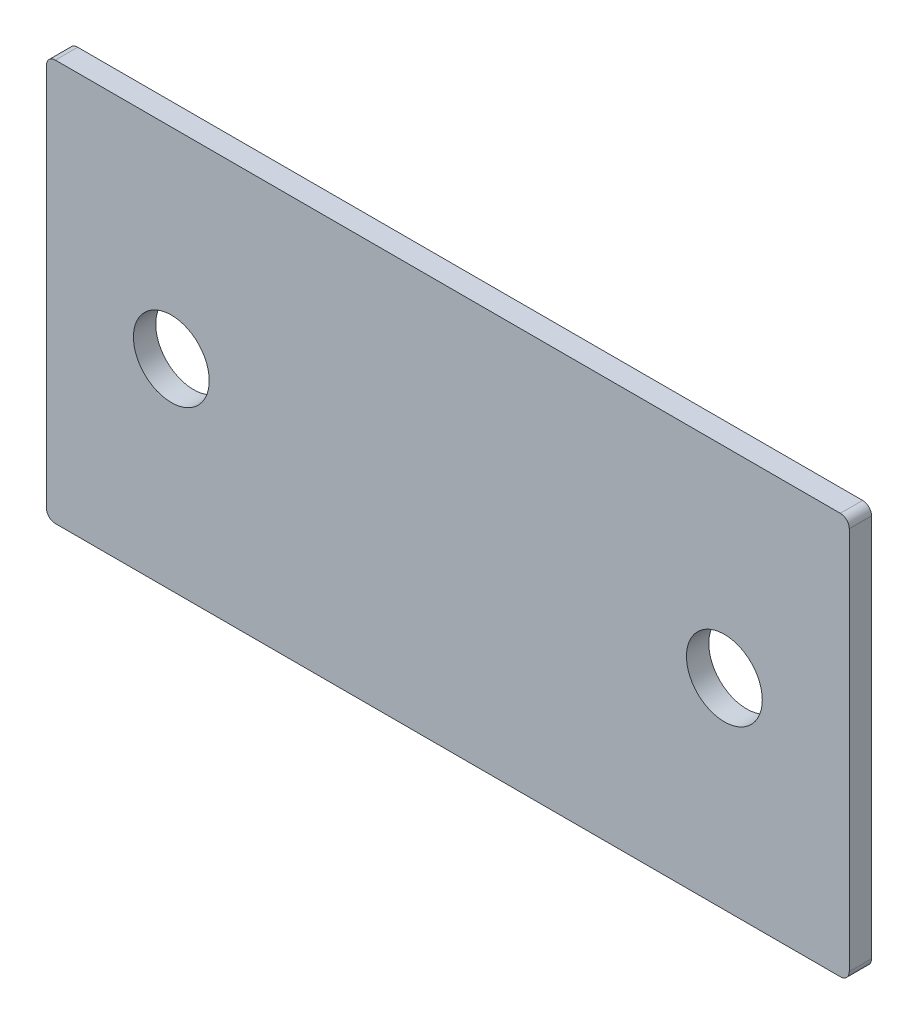
ISO-10303-21;
HEADER;
FILE_DESCRIPTION(('STEP AP214'),'2;1');
FILE_NAME('part.step','',(''),(''),'','','');
FILE_SCHEMA(('AUTOMOTIVE_DESIGN { 1 0 10303 214 1 1 1 1 }'));
ENDSEC;
DATA;
#1=APPLICATION_CONTEXT('core data for automotive mechanical design processes');
#2=APPLICATION_PROTOCOL_DEFINITION('international standard','automotive_design',2000,#1);
#3=PRODUCT_CONTEXT('',#1,'mechanical');
#4=PRODUCT('Part','Part','',(#3));
#5=PRODUCT_RELATED_PRODUCT_CATEGORY('part','',(#4));
#6=PRODUCT_DEFINITION_FORMATION('','',#4);
#7=PRODUCT_DEFINITION_CONTEXT('part definition',#1,'design');
#8=PRODUCT_DEFINITION('design','',#6,#7);
#9=PRODUCT_DEFINITION_SHAPE('','',#8);
#10=(LENGTH_UNIT() NAMED_UNIT(*) SI_UNIT(.MILLI.,.METRE.));
#11=(NAMED_UNIT(*) PLANE_ANGLE_UNIT() SI_UNIT($,.RADIAN.));
#12=(NAMED_UNIT(*) SI_UNIT($,.STERADIAN.) SOLID_ANGLE_UNIT());
#13=UNCERTAINTY_MEASURE_WITH_UNIT(LENGTH_MEASURE(1.E-05),#10,'distance_accuracy_value','');
#14=(GEOMETRIC_REPRESENTATION_CONTEXT(3) GLOBAL_UNCERTAINTY_ASSIGNED_CONTEXT((#13)) GLOBAL_UNIT_ASSIGNED_CONTEXT((#10,
#11,#12)) REPRESENTATION_CONTEXT('',''));
#15=CARTESIAN_POINT('',(0.,0.,0.));
#16=DIRECTION('',(0.,0.,1.));
#17=DIRECTION('',(1.,0.,0.));
#18=AXIS2_PLACEMENT_3D('',#15,#16,#17);
#19=CARTESIAN_POINT('',(0.,0.,2.5));
#20=DIRECTION('',(0.,0.,-1.));
#21=DIRECTION('',(-1.,0.,0.));
#22=AXIS2_PLACEMENT_3D('',#19,#20,#21);
#23=PLANE('',#22);
#24=DIRECTION('',(0.,-1.,0.));
#25=VECTOR('',#24,1.);
#26=CARTESIAN_POINT('',(-45.,-22.5,2.5));
#27=LINE('',#26,#25);
#28=CARTESIAN_POINT('',(-45.,21.5,2.5));
#29=VERTEX_POINT('',#28);
#30=CARTESIAN_POINT('',(-45.,-21.5,2.5));
#31=VERTEX_POINT('',#30);
#32=EDGE_CURVE('E173',#29,#31,#27,.T.);
#33=ORIENTED_EDGE('',*,*,#32,.T.);
#34=CARTESIAN_POINT('',(-44.,-21.5,2.5));
#35=DIRECTION('',(0.,0.,-1.));
#36=DIRECTION('',(-1.,0.,0.));
#37=AXIS2_PLACEMENT_3D('',#34,#35,#36);
#38=CIRCLE('',#37,1.);
#39=CARTESIAN_POINT('',(-44.,-22.5,2.5));
#40=VERTEX_POINT('',#39);
#41=EDGE_CURVE('E150',#31,#40,#38,.F.);
#42=ORIENTED_EDGE('',*,*,#41,.T.);
#43=DIRECTION('',(1.,0.,0.));
#44=VECTOR('',#43,1.);
#45=CARTESIAN_POINT('',(-45.,-22.5,2.5));
#46=LINE('',#45,#44);
#47=CARTESIAN_POINT('',(44.,-22.5,2.5));
#48=VERTEX_POINT('',#47);
#49=EDGE_CURVE('E121',#40,#48,#46,.T.);
#50=ORIENTED_EDGE('',*,*,#49,.T.);
#51=CARTESIAN_POINT('',(44.,-21.5,2.5));
#52=DIRECTION('',(0.,0.,-1.));
#53=DIRECTION('',(-1.,0.,0.));
#54=AXIS2_PLACEMENT_3D('',#51,#52,#53);
#55=CIRCLE('',#54,1.);
#56=CARTESIAN_POINT('',(45.,-21.5,2.5));
#57=VERTEX_POINT('',#56);
#58=EDGE_CURVE('E146',#48,#57,#55,.F.);
#59=ORIENTED_EDGE('',*,*,#58,.T.);
#60=DIRECTION('',(0.,1.,0.));
#61=VECTOR('',#60,1.);
#62=CARTESIAN_POINT('',(45.,-22.5,2.5));
#63=LINE('',#62,#61);
#64=CARTESIAN_POINT('',(45.,21.5,2.5));
#65=VERTEX_POINT('',#64);
#66=EDGE_CURVE('E129',#57,#65,#63,.T.);
#67=ORIENTED_EDGE('',*,*,#66,.T.);
#68=CARTESIAN_POINT('',(44.,21.5,2.5));
#69=DIRECTION('',(0.,0.,-1.));
#70=DIRECTION('',(-1.,0.,0.));
#71=AXIS2_PLACEMENT_3D('',#68,#69,#70);
#72=CIRCLE('',#71,1.);
#73=CARTESIAN_POINT('',(44.,22.5,2.5));
#74=VERTEX_POINT('',#73);
#75=EDGE_CURVE('E56',#65,#74,#72,.F.);
#76=ORIENTED_EDGE('',*,*,#75,.T.);
#77=DIRECTION('',(-1.,0.,0.));
#78=VECTOR('',#77,1.);
#79=CARTESIAN_POINT('',(-45.,22.5,2.5));
#80=LINE('',#79,#78);
#81=CARTESIAN_POINT('',(-44.,22.5,2.5));
#82=VERTEX_POINT('',#81);
#83=EDGE_CURVE('E132',#74,#82,#80,.T.);
#84=ORIENTED_EDGE('',*,*,#83,.T.);
#85=CARTESIAN_POINT('',(-44.,21.5,2.5));
#86=DIRECTION('',(0.,0.,-1.));
#87=DIRECTION('',(-1.,0.,0.));
#88=AXIS2_PLACEMENT_3D('',#85,#86,#87);
#89=CIRCLE('',#88,1.);
#90=EDGE_CURVE('E148',#82,#29,#89,.F.);
#91=ORIENTED_EDGE('',*,*,#90,.T.);
#92=EDGE_LOOP('',(#33,#42,#50,#59,#67,#76,#84,#91));
#93=FACE_BOUND('',#92,.T.);
#94=CARTESIAN_POINT('',(-31.,0.,2.5));
#95=DIRECTION('',(0.,0.,1.));
#96=DIRECTION('',(1.,0.,0.));
#97=AXIS2_PLACEMENT_3D('',#94,#95,#96);
#98=CIRCLE('',#97,4.25);
#99=CARTESIAN_POINT('',(-26.75,0.,2.5));
#100=VERTEX_POINT('',#99);
#101=EDGE_CURVE('E169',#100,#100,#98,.T.);
#102=ORIENTED_EDGE('',*,*,#101,.F.);
#103=EDGE_LOOP('',(#102));
#104=FACE_BOUND('',#103,.T.);
#105=CARTESIAN_POINT('',(31.,0.,2.5));
#106=DIRECTION('',(0.,0.,1.));
#107=DIRECTION('',(1.,0.,0.));
#108=AXIS2_PLACEMENT_3D('',#105,#106,#107);
#109=CIRCLE('',#108,4.25);
#110=CARTESIAN_POINT('',(35.25,0.,2.5));
#111=VERTEX_POINT('',#110);
#112=EDGE_CURVE('E179',#111,#111,#109,.T.);
#113=ORIENTED_EDGE('',*,*,#112,.F.);
#114=EDGE_LOOP('',(#113));
#115=FACE_BOUND('',#114,.T.);
#116=ADVANCED_FACE('F34',(#93,#104,#115),#23,.F.);
#117=CARTESIAN_POINT('',(0.,0.,0.));
#118=DIRECTION('',(0.,0.,-1.));
#119=DIRECTION('',(-1.,0.,0.));
#120=AXIS2_PLACEMENT_3D('',#117,#118,#119);
#121=PLANE('',#120);
#122=CARTESIAN_POINT('',(-31.,0.,0.));
#123=DIRECTION('',(0.,0.,1.));
#124=DIRECTION('',(1.,0.,0.));
#125=AXIS2_PLACEMENT_3D('',#122,#123,#124);
#126=CIRCLE('',#125,4.25);
#127=CARTESIAN_POINT('',(-26.75,0.,0.));
#128=VERTEX_POINT('',#127);
#129=EDGE_CURVE('E176',#128,#128,#126,.T.);
#130=ORIENTED_EDGE('',*,*,#129,.T.);
#131=EDGE_LOOP('',(#130));
#132=FACE_BOUND('',#131,.T.);
#133=DIRECTION('',(1.,0.,0.));
#134=VECTOR('',#133,1.);
#135=CARTESIAN_POINT('',(-45.,-22.5,0.));
#136=LINE('',#135,#134);
#137=CARTESIAN_POINT('',(-44.,-22.5,0.));
#138=VERTEX_POINT('',#137);
#139=CARTESIAN_POINT('',(44.,-22.5,0.));
#140=VERTEX_POINT('',#139);
#141=EDGE_CURVE('E118',#138,#140,#136,.T.);
#142=ORIENTED_EDGE('',*,*,#141,.F.);
#143=CARTESIAN_POINT('',(-44.,-21.5,0.));
#144=DIRECTION('',(0.,0.,-1.));
#145=DIRECTION('',(-1.,0.,0.));
#146=AXIS2_PLACEMENT_3D('',#143,#144,#145);
#147=CIRCLE('',#146,1.);
#148=CARTESIAN_POINT('',(-45.,-21.5,0.));
#149=VERTEX_POINT('',#148);
#150=EDGE_CURVE('E101',#138,#149,#147,.T.);
#151=ORIENTED_EDGE('',*,*,#150,.T.);
#152=DIRECTION('',(0.,-1.,0.));
#153=VECTOR('',#152,1.);
#154=CARTESIAN_POINT('',(-45.,-22.5,0.));
#155=LINE('',#154,#153);
#156=CARTESIAN_POINT('',(-45.,21.5,0.));
#157=VERTEX_POINT('',#156);
#158=EDGE_CURVE('E130',#157,#149,#155,.T.);
#159=ORIENTED_EDGE('',*,*,#158,.F.);
#160=CARTESIAN_POINT('',(-44.,21.5,0.));
#161=DIRECTION('',(0.,0.,-1.));
#162=DIRECTION('',(-1.,0.,0.));
#163=AXIS2_PLACEMENT_3D('',#160,#161,#162);
#164=CIRCLE('',#163,1.);
#165=CARTESIAN_POINT('',(-44.,22.5,0.));
#166=VERTEX_POINT('',#165);
#167=EDGE_CURVE('E112',#157,#166,#164,.T.);
#168=ORIENTED_EDGE('',*,*,#167,.T.);
#169=DIRECTION('',(-1.,0.,0.));
#170=VECTOR('',#169,1.);
#171=CARTESIAN_POINT('',(-45.,22.5,0.));
#172=LINE('',#171,#170);
#173=CARTESIAN_POINT('',(44.,22.5,0.));
#174=VERTEX_POINT('',#173);
#175=EDGE_CURVE('E134',#174,#166,#172,.T.);
#176=ORIENTED_EDGE('',*,*,#175,.F.);
#177=CARTESIAN_POINT('',(44.,21.5,0.));
#178=DIRECTION('',(0.,0.,-1.));
#179=DIRECTION('',(-1.,0.,0.));
#180=AXIS2_PLACEMENT_3D('',#177,#178,#179);
#181=CIRCLE('',#180,1.);
#182=CARTESIAN_POINT('',(45.,21.5,0.));
#183=VERTEX_POINT('',#182);
#184=EDGE_CURVE('E122',#174,#183,#181,.T.);
#185=ORIENTED_EDGE('',*,*,#184,.T.);
#186=DIRECTION('',(0.,1.,0.));
#187=VECTOR('',#186,1.);
#188=CARTESIAN_POINT('',(45.,-22.5,0.));
#189=LINE('',#188,#187);
#190=CARTESIAN_POINT('',(45.,-21.5,0.));
#191=VERTEX_POINT('',#190);
#192=EDGE_CURVE('E161',#191,#183,#189,.T.);
#193=ORIENTED_EDGE('',*,*,#192,.F.);
#194=CARTESIAN_POINT('',(44.,-21.5,0.));
#195=DIRECTION('',(0.,0.,-1.));
#196=DIRECTION('',(-1.,0.,0.));
#197=AXIS2_PLACEMENT_3D('',#194,#195,#196);
#198=CIRCLE('',#197,1.);
#199=EDGE_CURVE('E128',#191,#140,#198,.T.);
#200=ORIENTED_EDGE('',*,*,#199,.T.);
#201=EDGE_LOOP('',(#142,#151,#159,#168,#176,#185,#193,#200));
#202=FACE_BOUND('',#201,.T.);
#203=CARTESIAN_POINT('',(31.,0.,0.));
#204=DIRECTION('',(0.,0.,1.));
#205=DIRECTION('',(1.,0.,0.));
#206=AXIS2_PLACEMENT_3D('',#203,#204,#205);
#207=CIRCLE('',#206,4.25);
#208=CARTESIAN_POINT('',(35.25,0.,0.));
#209=VERTEX_POINT('',#208);
#210=EDGE_CURVE('E182',#209,#209,#207,.T.);
#211=ORIENTED_EDGE('',*,*,#210,.T.);
#212=EDGE_LOOP('',(#211));
#213=FACE_BOUND('',#212,.T.);
#214=ADVANCED_FACE('F125',(#132,#202,#213),#121,.T.);
#215=CARTESIAN_POINT('',(45.,-22.5,2.5));
#216=DIRECTION('',(-1.,0.,0.));
#217=DIRECTION('',(0.,0.,1.));
#218=AXIS2_PLACEMENT_3D('',#215,#216,#217);
#219=PLANE('',#218);
#220=ORIENTED_EDGE('',*,*,#66,.F.);
#221=DIRECTION('',(0.,0.,-1.));
#222=VECTOR('',#221,1.);
#223=CARTESIAN_POINT('',(45.,-21.5,2.5));
#224=LINE('',#223,#222);
#225=EDGE_CURVE('E11',#57,#191,#224,.T.);
#226=ORIENTED_EDGE('',*,*,#225,.T.);
#227=ORIENTED_EDGE('',*,*,#192,.T.);
#228=DIRECTION('',(0.,0.,-1.));
#229=VECTOR('',#228,1.);
#230=CARTESIAN_POINT('',(45.,21.5,2.5));
#231=LINE('',#230,#229);
#232=EDGE_CURVE('E42',#183,#65,#231,.F.);
#233=ORIENTED_EDGE('',*,*,#232,.T.);
#234=EDGE_LOOP('',(#220,#226,#227,#233));
#235=FACE_BOUND('',#234,.T.);
#236=ADVANCED_FACE('F159',(#235),#219,.F.);
#237=CARTESIAN_POINT('',(-45.,22.5,2.5));
#238=DIRECTION('',(0.,-1.,0.));
#239=DIRECTION('',(0.,0.,-1.));
#240=AXIS2_PLACEMENT_3D('',#237,#238,#239);
#241=PLANE('',#240);
#242=ORIENTED_EDGE('',*,*,#175,.T.);
#243=DIRECTION('',(0.,0.,-1.));
#244=VECTOR('',#243,1.);
#245=CARTESIAN_POINT('',(-44.,22.5,2.5));
#246=LINE('',#245,#244);
#247=EDGE_CURVE('E49',#166,#82,#246,.F.);
#248=ORIENTED_EDGE('',*,*,#247,.T.);
#249=ORIENTED_EDGE('',*,*,#83,.F.);
#250=DIRECTION('',(0.,0.,-1.));
#251=VECTOR('',#250,1.);
#252=CARTESIAN_POINT('',(44.,22.5,2.5));
#253=LINE('',#252,#251);
#254=EDGE_CURVE('E152',#74,#174,#253,.T.);
#255=ORIENTED_EDGE('',*,*,#254,.T.);
#256=EDGE_LOOP('',(#242,#248,#249,#255));
#257=FACE_BOUND('',#256,.T.);
#258=ADVANCED_FACE('F168',(#257),#241,.F.);
#259=CARTESIAN_POINT('',(-45.,-22.5,2.5));
#260=DIRECTION('',(1.,0.,0.));
#261=DIRECTION('',(0.,0.,-1.));
#262=AXIS2_PLACEMENT_3D('',#259,#260,#261);
#263=PLANE('',#262);
#264=ORIENTED_EDGE('',*,*,#158,.T.);
#265=DIRECTION('',(0.,0.,-1.));
#266=VECTOR('',#265,1.);
#267=CARTESIAN_POINT('',(-45.,-21.5,2.5));
#268=LINE('',#267,#266);
#269=EDGE_CURVE('E106',#149,#31,#268,.F.);
#270=ORIENTED_EDGE('',*,*,#269,.T.);
#271=ORIENTED_EDGE('',*,*,#32,.F.);
#272=DIRECTION('',(0.,0.,-1.));
#273=VECTOR('',#272,1.);
#274=CARTESIAN_POINT('',(-45.,21.5,2.5));
#275=LINE('',#274,#273);
#276=EDGE_CURVE('E111',#29,#157,#275,.T.);
#277=ORIENTED_EDGE('',*,*,#276,.T.);
#278=EDGE_LOOP('',(#264,#270,#271,#277));
#279=FACE_BOUND('',#278,.T.);
#280=ADVANCED_FACE('F204',(#279),#263,.F.);
#281=CARTESIAN_POINT('',(-45.,-22.5,2.5));
#282=DIRECTION('',(0.,1.,0.));
#283=DIRECTION('',(0.,0.,1.));
#284=AXIS2_PLACEMENT_3D('',#281,#282,#283);
#285=PLANE('',#284);
#286=ORIENTED_EDGE('',*,*,#49,.F.);
#287=DIRECTION('',(0.,0.,-1.));
#288=VECTOR('',#287,1.);
#289=CARTESIAN_POINT('',(-44.,-22.5,2.5));
#290=LINE('',#289,#288);
#291=EDGE_CURVE('E105',#40,#138,#290,.T.);
#292=ORIENTED_EDGE('',*,*,#291,.T.);
#293=ORIENTED_EDGE('',*,*,#141,.T.);
#294=DIRECTION('',(0.,0.,-1.));
#295=VECTOR('',#294,1.);
#296=CARTESIAN_POINT('',(44.,-22.5,2.5));
#297=LINE('',#296,#295);
#298=EDGE_CURVE('E123',#140,#48,#297,.F.);
#299=ORIENTED_EDGE('',*,*,#298,.T.);
#300=EDGE_LOOP('',(#286,#292,#293,#299));
#301=FACE_BOUND('',#300,.T.);
#302=ADVANCED_FACE('F117',(#301),#285,.F.);
#303=CARTESIAN_POINT('',(-31.,0.,2.5));
#304=DIRECTION('',(0.,0.,-1.));
#305=DIRECTION('',(-1.,0.,0.));
#306=AXIS2_PLACEMENT_3D('',#303,#304,#305);
#307=CYLINDRICAL_SURFACE('',#306,4.25);
#308=ORIENTED_EDGE('',*,*,#101,.T.);
#309=EDGE_LOOP('',(#308));
#310=FACE_BOUND('',#309,.T.);
#311=ORIENTED_EDGE('',*,*,#129,.F.);
#312=EDGE_LOOP('',(#311));
#313=FACE_BOUND('',#312,.T.);
#314=ADVANCED_FACE('F199',(#310,#313),#307,.F.);
#315=CARTESIAN_POINT('',(31.,0.,2.5));
#316=DIRECTION('',(0.,0.,-1.));
#317=DIRECTION('',(-1.,0.,0.));
#318=AXIS2_PLACEMENT_3D('',#315,#316,#317);
#319=CYLINDRICAL_SURFACE('',#318,4.25);
#320=ORIENTED_EDGE('',*,*,#112,.T.);
#321=EDGE_LOOP('',(#320));
#322=FACE_BOUND('',#321,.T.);
#323=ORIENTED_EDGE('',*,*,#210,.F.);
#324=EDGE_LOOP('',(#323));
#325=FACE_BOUND('',#324,.T.);
#326=ADVANCED_FACE('F188',(#322,#325),#319,.F.);
#327=CARTESIAN_POINT('',(-44.,-21.5,2.5));
#328=DIRECTION('',(0.,0.,-1.));
#329=DIRECTION('',(-1.,0.,0.));
#330=AXIS2_PLACEMENT_3D('',#327,#328,#329);
#331=CYLINDRICAL_SURFACE('',#330,1.);
#332=ORIENTED_EDGE('',*,*,#41,.F.);
#333=ORIENTED_EDGE('',*,*,#269,.F.);
#334=ORIENTED_EDGE('',*,*,#150,.F.);
#335=ORIENTED_EDGE('',*,*,#291,.F.);
#336=EDGE_LOOP('',(#332,#333,#334,#335));
#337=FACE_BOUND('',#336,.T.);
#338=ADVANCED_FACE('F104',(#337),#331,.T.);
#339=CARTESIAN_POINT('',(-44.,21.5,2.5));
#340=DIRECTION('',(0.,0.,-1.));
#341=DIRECTION('',(-1.,0.,0.));
#342=AXIS2_PLACEMENT_3D('',#339,#340,#341);
#343=CYLINDRICAL_SURFACE('',#342,1.);
#344=ORIENTED_EDGE('',*,*,#90,.F.);
#345=ORIENTED_EDGE('',*,*,#247,.F.);
#346=ORIENTED_EDGE('',*,*,#167,.F.);
#347=ORIENTED_EDGE('',*,*,#276,.F.);
#348=EDGE_LOOP('',(#344,#345,#346,#347));
#349=FACE_BOUND('',#348,.T.);
#350=ADVANCED_FACE('F214',(#349),#343,.T.);
#351=CARTESIAN_POINT('',(44.,-21.5,2.5));
#352=DIRECTION('',(0.,0.,-1.));
#353=DIRECTION('',(-1.,0.,0.));
#354=AXIS2_PLACEMENT_3D('',#351,#352,#353);
#355=CYLINDRICAL_SURFACE('',#354,1.);
#356=ORIENTED_EDGE('',*,*,#58,.F.);
#357=ORIENTED_EDGE('',*,*,#298,.F.);
#358=ORIENTED_EDGE('',*,*,#199,.F.);
#359=ORIENTED_EDGE('',*,*,#225,.F.);
#360=EDGE_LOOP('',(#356,#357,#358,#359));
#361=FACE_BOUND('',#360,.T.);
#362=ADVANCED_FACE('F216',(#361),#355,.T.);
#363=CARTESIAN_POINT('',(44.,21.5,2.5));
#364=DIRECTION('',(0.,0.,-1.));
#365=DIRECTION('',(-1.,0.,0.));
#366=AXIS2_PLACEMENT_3D('',#363,#364,#365);
#367=CYLINDRICAL_SURFACE('',#366,1.);
#368=ORIENTED_EDGE('',*,*,#75,.F.);
#369=ORIENTED_EDGE('',*,*,#232,.F.);
#370=ORIENTED_EDGE('',*,*,#184,.F.);
#371=ORIENTED_EDGE('',*,*,#254,.F.);
#372=EDGE_LOOP('',(#368,#369,#370,#371));
#373=FACE_BOUND('',#372,.T.);
#374=ADVANCED_FACE('F36',(#373),#367,.T.);
#375=CLOSED_SHELL('',(#116,#214,#236,#258,#280,#302,#314,#326,#338,#350,#362,#374));
#376=MANIFOLD_SOLID_BREP('B2',#375);
#377=ADVANCED_BREP_SHAPE_REPRESENTATION('',(#18,#376),#14);
#378=SHAPE_DEFINITION_REPRESENTATION(#9,#377);
ENDSEC;
END-ISO-10303-21;
